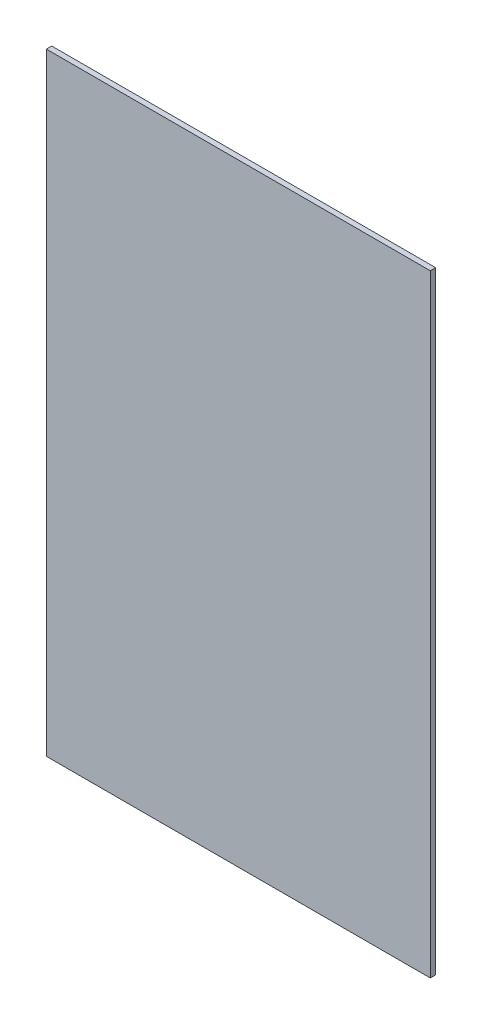
ISO-10303-21;
HEADER;
FILE_DESCRIPTION(('STEP AP214'),'2;1');
FILE_NAME('part.step','',(''),(''),'','','');
FILE_SCHEMA(('AUTOMOTIVE_DESIGN { 1 0 10303 214 1 1 1 1 }'));
ENDSEC;
DATA;
#1=APPLICATION_CONTEXT('core data for automotive mechanical design processes');
#2=APPLICATION_PROTOCOL_DEFINITION('international standard','automotive_design',2000,#1);
#3=PRODUCT_CONTEXT('',#1,'mechanical');
#4=PRODUCT('Part','Part','',(#3));
#5=PRODUCT_RELATED_PRODUCT_CATEGORY('part','',(#4));
#6=PRODUCT_DEFINITION_FORMATION('','',#4);
#7=PRODUCT_DEFINITION_CONTEXT('part definition',#1,'design');
#8=PRODUCT_DEFINITION('design','',#6,#7);
#9=PRODUCT_DEFINITION_SHAPE('','',#8);
#10=(LENGTH_UNIT() NAMED_UNIT(*) SI_UNIT(.MILLI.,.METRE.));
#11=(NAMED_UNIT(*) PLANE_ANGLE_UNIT() SI_UNIT($,.RADIAN.));
#12=(NAMED_UNIT(*) SI_UNIT($,.STERADIAN.) SOLID_ANGLE_UNIT());
#13=UNCERTAINTY_MEASURE_WITH_UNIT(LENGTH_MEASURE(1.E-05),#10,'distance_accuracy_value','');
#14=(GEOMETRIC_REPRESENTATION_CONTEXT(3) GLOBAL_UNCERTAINTY_ASSIGNED_CONTEXT((#13)) GLOBAL_UNIT_ASSIGNED_CONTEXT((#10,
#11,#12)) REPRESENTATION_CONTEXT('',''));
#15=CARTESIAN_POINT('',(0.,0.,0.));
#16=DIRECTION('',(0.,0.,1.));
#17=DIRECTION('',(1.,0.,0.));
#18=AXIS2_PLACEMENT_3D('',#15,#16,#17);
#19=CARTESIAN_POINT('',(107.5,330.,-125.5));
#20=DIRECTION('',(-1.,0.,0.));
#21=DIRECTION('',(0.,0.,1.));
#22=AXIS2_PLACEMENT_3D('',#19,#20,#21);
#23=PLANE('',#22);
#24=DIRECTION('',(0.,-1.,0.));
#25=VECTOR('',#24,1.);
#26=CARTESIAN_POINT('',(107.5,330.,-122.5));
#27=LINE('',#26,#25);
#28=CARTESIAN_POINT('',(107.5,330.,-122.5));
#29=VERTEX_POINT('',#28);
#30=CARTESIAN_POINT('',(107.5,-13.,-122.5));
#31=VERTEX_POINT('',#30);
#32=EDGE_CURVE('E101',#29,#31,#27,.T.);
#33=ORIENTED_EDGE('',*,*,#32,.T.);
#34=DIRECTION('',(0.,0.,1.));
#35=VECTOR('',#34,1.);
#36=CARTESIAN_POINT('',(107.5,-13.,-125.5));
#37=LINE('',#36,#35);
#38=CARTESIAN_POINT('',(107.5,-13.,-125.5));
#39=VERTEX_POINT('',#38);
#40=EDGE_CURVE('E11',#39,#31,#37,.T.);
#41=ORIENTED_EDGE('',*,*,#40,.F.);
#42=DIRECTION('',(0.,-1.,0.));
#43=VECTOR('',#42,1.);
#44=CARTESIAN_POINT('',(107.5,330.,-125.5));
#45=LINE('',#44,#43);
#46=CARTESIAN_POINT('',(107.5,330.,-125.5));
#47=VERTEX_POINT('',#46);
#48=EDGE_CURVE('E89',#47,#39,#45,.T.);
#49=ORIENTED_EDGE('',*,*,#48,.F.);
#50=DIRECTION('',(0.,0.,1.));
#51=VECTOR('',#50,1.);
#52=CARTESIAN_POINT('',(107.5,330.,-125.5));
#53=LINE('',#52,#51);
#54=EDGE_CURVE('E97',#47,#29,#53,.T.);
#55=ORIENTED_EDGE('',*,*,#54,.T.);
#56=EDGE_LOOP('',(#33,#41,#49,#55));
#57=FACE_BOUND('',#56,.T.);
#58=ADVANCED_FACE('F38',(#57),#23,.F.);
#59=CARTESIAN_POINT('',(107.5,-13.,-125.5));
#60=DIRECTION('',(0.,1.,0.));
#61=DIRECTION('',(0.,0.,1.));
#62=AXIS2_PLACEMENT_3D('',#59,#60,#61);
#63=PLANE('',#62);
#64=DIRECTION('',(-1.,0.,0.));
#65=VECTOR('',#64,1.);
#66=CARTESIAN_POINT('',(107.5,-13.,-122.5));
#67=LINE('',#66,#65);
#68=CARTESIAN_POINT('',(-107.5,-13.,-122.500000000002));
#69=VERTEX_POINT('',#68);
#70=EDGE_CURVE('E93',#31,#69,#67,.T.);
#71=ORIENTED_EDGE('',*,*,#70,.T.);
#72=DIRECTION('',(0.,0.,1.));
#73=VECTOR('',#72,1.);
#74=CARTESIAN_POINT('',(-107.5,-13.,-125.500000000002));
#75=LINE('',#74,#73);
#76=CARTESIAN_POINT('',(-107.5,-13.,-125.500000000002));
#77=VERTEX_POINT('',#76);
#78=EDGE_CURVE('E46',#77,#69,#75,.T.);
#79=ORIENTED_EDGE('',*,*,#78,.F.);
#80=DIRECTION('',(-1.,0.,0.));
#81=VECTOR('',#80,1.);
#82=CARTESIAN_POINT('',(107.5,-13.,-125.5));
#83=LINE('',#82,#81);
#84=EDGE_CURVE('E84',#39,#77,#83,.T.);
#85=ORIENTED_EDGE('',*,*,#84,.F.);
#86=ORIENTED_EDGE('',*,*,#40,.T.);
#87=EDGE_LOOP('',(#71,#79,#85,#86));
#88=FACE_BOUND('',#87,.T.);
#89=ADVANCED_FACE('F92',(#88),#63,.F.);
#90=CARTESIAN_POINT('',(-107.5,330.,-125.500000000002));
#91=DIRECTION('',(1.,0.,0.));
#92=DIRECTION('',(0.,0.,-1.));
#93=AXIS2_PLACEMENT_3D('',#90,#91,#92);
#94=PLANE('',#93);
#95=DIRECTION('',(0.,1.,0.));
#96=VECTOR('',#95,1.);
#97=CARTESIAN_POINT('',(-107.5,330.,-122.500000000002));
#98=LINE('',#97,#96);
#99=CARTESIAN_POINT('',(-107.5,330.,-122.500000000002));
#100=VERTEX_POINT('',#99);
#101=EDGE_CURVE('E71',#69,#100,#98,.T.);
#102=ORIENTED_EDGE('',*,*,#101,.T.);
#103=DIRECTION('',(0.,0.,1.));
#104=VECTOR('',#103,1.);
#105=CARTESIAN_POINT('',(-107.5,330.,-125.500000000002));
#106=LINE('',#105,#104);
#107=CARTESIAN_POINT('',(-107.5,330.,-125.500000000002));
#108=VERTEX_POINT('',#107);
#109=EDGE_CURVE('E94',#108,#100,#106,.T.);
#110=ORIENTED_EDGE('',*,*,#109,.F.);
#111=DIRECTION('',(0.,1.,0.));
#112=VECTOR('',#111,1.);
#113=CARTESIAN_POINT('',(-107.5,330.,-125.500000000002));
#114=LINE('',#113,#112);
#115=EDGE_CURVE('E87',#77,#108,#114,.T.);
#116=ORIENTED_EDGE('',*,*,#115,.F.);
#117=ORIENTED_EDGE('',*,*,#78,.T.);
#118=EDGE_LOOP('',(#102,#110,#116,#117));
#119=FACE_BOUND('',#118,.T.);
#120=ADVANCED_FACE('F95',(#119),#94,.F.);
#121=CARTESIAN_POINT('',(107.5,330.,-125.5));
#122=DIRECTION('',(0.,-1.,0.));
#123=DIRECTION('',(0.,0.,-1.));
#124=AXIS2_PLACEMENT_3D('',#121,#122,#123);
#125=PLANE('',#124);
#126=DIRECTION('',(1.,0.,0.));
#127=VECTOR('',#126,1.);
#128=CARTESIAN_POINT('',(107.5,330.,-122.5));
#129=LINE('',#128,#127);
#130=EDGE_CURVE('E77',#100,#29,#129,.T.);
#131=ORIENTED_EDGE('',*,*,#130,.T.);
#132=ORIENTED_EDGE('',*,*,#54,.F.);
#133=DIRECTION('',(1.,0.,0.));
#134=VECTOR('',#133,1.);
#135=CARTESIAN_POINT('',(107.5,330.,-125.5));
#136=LINE('',#135,#134);
#137=EDGE_CURVE('E54',#108,#47,#136,.T.);
#138=ORIENTED_EDGE('',*,*,#137,.F.);
#139=ORIENTED_EDGE('',*,*,#109,.T.);
#140=EDGE_LOOP('',(#131,#132,#138,#139));
#141=FACE_BOUND('',#140,.T.);
#142=ADVANCED_FACE('F108',(#141),#125,.F.);
#143=CARTESIAN_POINT('',(1.29618147673363E-12,0.,-125.500000000001));
#144=DIRECTION('',(0.,0.,-1.));
#145=DIRECTION('',(-1.,0.,0.));
#146=AXIS2_PLACEMENT_3D('',#143,#144,#145);
#147=PLANE('',#146);
#148=ORIENTED_EDGE('',*,*,#48,.T.);
#149=ORIENTED_EDGE('',*,*,#84,.T.);
#150=ORIENTED_EDGE('',*,*,#115,.T.);
#151=ORIENTED_EDGE('',*,*,#137,.T.);
#152=EDGE_LOOP('',(#148,#149,#150,#151));
#153=FACE_BOUND('',#152,.T.);
#154=ADVANCED_FACE('F85',(#153),#147,.T.);
#155=CARTESIAN_POINT('',(1.26513786527054E-12,0.,-122.500000000001));
#156=DIRECTION('',(0.,0.,-1.));
#157=DIRECTION('',(-1.,0.,0.));
#158=AXIS2_PLACEMENT_3D('',#155,#156,#157);
#159=PLANE('',#158);
#160=ORIENTED_EDGE('',*,*,#32,.F.);
#161=ORIENTED_EDGE('',*,*,#130,.F.);
#162=ORIENTED_EDGE('',*,*,#101,.F.);
#163=ORIENTED_EDGE('',*,*,#70,.F.);
#164=EDGE_LOOP('',(#160,#161,#162,#163));
#165=FACE_BOUND('',#164,.T.);
#166=ADVANCED_FACE('F111',(#165),#159,.F.);
#167=CLOSED_SHELL('',(#58,#89,#120,#142,#154,#166));
#168=MANIFOLD_SOLID_BREP('B2',#167);
#169=ADVANCED_BREP_SHAPE_REPRESENTATION('',(#18,#168),#14);
#170=SHAPE_DEFINITION_REPRESENTATION(#9,#169);
ENDSEC;
END-ISO-10303-21;
